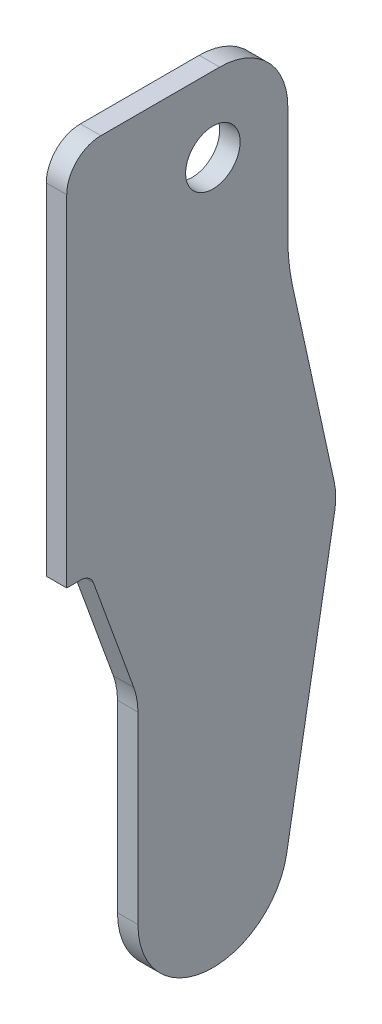
ISO-10303-21;
HEADER;
FILE_DESCRIPTION(('STEP AP214'),'2;1');
FILE_NAME('part.step','',(''),(''),'','','');
FILE_SCHEMA(('AUTOMOTIVE_DESIGN { 1 0 10303 214 1 1 1 1 }'));
ENDSEC;
DATA;
#1=APPLICATION_CONTEXT('core data for automotive mechanical design processes');
#2=APPLICATION_PROTOCOL_DEFINITION('international standard','automotive_design',2000,#1);
#3=PRODUCT_CONTEXT('',#1,'mechanical');
#4=PRODUCT('Part','Part','',(#3));
#5=PRODUCT_RELATED_PRODUCT_CATEGORY('part','',(#4));
#6=PRODUCT_DEFINITION_FORMATION('','',#4);
#7=PRODUCT_DEFINITION_CONTEXT('part definition',#1,'design');
#8=PRODUCT_DEFINITION('design','',#6,#7);
#9=PRODUCT_DEFINITION_SHAPE('','',#8);
#10=(LENGTH_UNIT() NAMED_UNIT(*) SI_UNIT(.MILLI.,.METRE.));
#11=(NAMED_UNIT(*) PLANE_ANGLE_UNIT() SI_UNIT($,.RADIAN.));
#12=(NAMED_UNIT(*) SI_UNIT($,.STERADIAN.) SOLID_ANGLE_UNIT());
#13=UNCERTAINTY_MEASURE_WITH_UNIT(LENGTH_MEASURE(1.E-05),#10,'distance_accuracy_value','');
#14=(GEOMETRIC_REPRESENTATION_CONTEXT(3) GLOBAL_UNCERTAINTY_ASSIGNED_CONTEXT((#13)) GLOBAL_UNIT_ASSIGNED_CONTEXT((#10,
#11,#12)) REPRESENTATION_CONTEXT('',''));
#15=CARTESIAN_POINT('',(0.,0.,0.));
#16=DIRECTION('',(0.,0.,1.));
#17=DIRECTION('',(1.,0.,0.));
#18=AXIS2_PLACEMENT_3D('',#15,#16,#17);
#19=CARTESIAN_POINT('',(17.5,-190.,21.4494897427832));
#20=DIRECTION('',(0.,0.,1.));
#21=DIRECTION('',(1.,0.,0.));
#22=AXIS2_PLACEMENT_3D('',#19,#20,#21);
#23=PLANE('',#22);
#24=DIRECTION('',(0.,1.,0.));
#25=VECTOR('',#24,1.);
#26=CARTESIAN_POINT('',(17.5,-190.,21.4494897427832));
#27=LINE('',#26,#25);
#28=CARTESIAN_POINT('',(17.5,-190.,21.4494897427832));
#29=VERTEX_POINT('',#28);
#30=CARTESIAN_POINT('',(17.5,-140.,21.4494897427832));
#31=VERTEX_POINT('',#30);
#32=EDGE_CURVE('E176',#29,#31,#27,.T.);
#33=ORIENTED_EDGE('',*,*,#32,.T.);
#34=DIRECTION('',(-1.,0.,0.));
#35=VECTOR('',#34,1.);
#36=CARTESIAN_POINT('',(17.5,-140.,21.4494897427832));
#37=LINE('',#36,#35);
#38=CARTESIAN_POINT('',(14.5,-140.,21.4494897427832));
#39=VERTEX_POINT('',#38);
#40=EDGE_CURVE('E245',#31,#39,#37,.T.);
#41=ORIENTED_EDGE('',*,*,#40,.T.);
#42=DIRECTION('',(0.,1.,0.));
#43=VECTOR('',#42,1.);
#44=CARTESIAN_POINT('',(14.5,-190.,21.4494897427832));
#45=LINE('',#44,#43);
#46=CARTESIAN_POINT('',(14.5,-190.,21.4494897427832));
#47=VERTEX_POINT('',#46);
#48=EDGE_CURVE('E213',#47,#39,#45,.T.);
#49=ORIENTED_EDGE('',*,*,#48,.F.);
#50=DIRECTION('',(-1.,0.,0.));
#51=VECTOR('',#50,1.);
#52=CARTESIAN_POINT('',(17.5,-190.,21.4494897427832));
#53=LINE('',#52,#51);
#54=EDGE_CURVE('E243',#29,#47,#53,.T.);
#55=ORIENTED_EDGE('',*,*,#54,.F.);
#56=EDGE_LOOP('',(#33,#41,#49,#55));
#57=FACE_BOUND('',#56,.T.);
#58=ADVANCED_FACE('F39',(#57),#23,.T.);
#59=CARTESIAN_POINT('',(17.5,-190.000000000001,19.40041507642));
#60=DIRECTION('',(0.,-1.,5.28271354274638E-13));
#61=DIRECTION('',(0.,-5.28271354274638E-13,-1.));
#62=AXIS2_PLACEMENT_3D('',#59,#60,#61);
#63=PLANE('',#62);
#64=ORIENTED_EDGE('',*,*,#54,.T.);
#65=DIRECTION('',(0.,5.28271354274638E-13,1.));
#66=VECTOR('',#65,1.);
#67=CARTESIAN_POINT('',(14.5,-190.000000000001,19.40041507642));
#68=LINE('',#67,#66);
#69=CARTESIAN_POINT('',(14.5,-190.000000000002,19.40041507642));
#70=VERTEX_POINT('',#69);
#71=EDGE_CURVE('E180',#70,#47,#68,.T.);
#72=ORIENTED_EDGE('',*,*,#71,.F.);
#73=DIRECTION('',(-1.,0.,0.));
#74=VECTOR('',#73,1.);
#75=CARTESIAN_POINT('',(17.5,-190.000000000002,19.40041507642));
#76=LINE('',#75,#74);
#77=CARTESIAN_POINT('',(17.5,-190.000000000002,19.40041507642));
#78=VERTEX_POINT('',#77);
#79=EDGE_CURVE('E246',#78,#70,#76,.T.);
#80=ORIENTED_EDGE('',*,*,#79,.F.);
#81=DIRECTION('',(0.,5.28271354274638E-13,1.));
#82=VECTOR('',#81,1.);
#83=CARTESIAN_POINT('',(17.5,-190.000000000001,19.40041507642));
#84=LINE('',#83,#82);
#85=EDGE_CURVE('E210',#78,#29,#84,.T.);
#86=ORIENTED_EDGE('',*,*,#85,.T.);
#87=EDGE_LOOP('',(#64,#72,#80,#86));
#88=FACE_BOUND('',#87,.T.);
#89=ADVANCED_FACE('F276',(#88),#63,.T.);
#90=CARTESIAN_POINT('',(17.5,-192.,19.40041507642));
#91=DIRECTION('',(-1.,0.,0.));
#92=DIRECTION('',(0.,0.,1.));
#93=AXIS2_PLACEMENT_3D('',#90,#91,#92);
#94=CYLINDRICAL_SURFACE('',#93,1.99999999999838);
#95=ORIENTED_EDGE('',*,*,#79,.T.);
#96=CARTESIAN_POINT('',(14.5,-192.,19.40041507642));
#97=DIRECTION('',(1.,0.,0.));
#98=DIRECTION('',(0.,0.,1.));
#99=AXIS2_PLACEMENT_3D('',#96,#97,#98);
#100=CIRCLE('',#99,1.99999999999838);
#101=CARTESIAN_POINT('',(14.5,-191.31595971335,17.52102983485));
#102=VERTEX_POINT('',#101);
#103=EDGE_CURVE('E238',#102,#70,#100,.T.);
#104=ORIENTED_EDGE('',*,*,#103,.F.);
#105=DIRECTION('',(-1.,0.,0.));
#106=VECTOR('',#105,1.);
#107=CARTESIAN_POINT('',(17.5,-191.31595971335,17.52102983485));
#108=LINE('',#107,#106);
#109=CARTESIAN_POINT('',(17.5,-191.31595971335,17.52102983485));
#110=VERTEX_POINT('',#109);
#111=EDGE_CURVE('E248',#110,#102,#108,.T.);
#112=ORIENTED_EDGE('',*,*,#111,.F.);
#113=CARTESIAN_POINT('',(17.5,-192.,19.40041507642));
#114=DIRECTION('',(1.,0.,0.));
#115=DIRECTION('',(0.,0.,1.));
#116=AXIS2_PLACEMENT_3D('',#113,#114,#115);
#117=CIRCLE('',#116,1.99999999999838);
#118=EDGE_CURVE('E207',#110,#78,#117,.T.);
#119=ORIENTED_EDGE('',*,*,#118,.T.);
#120=EDGE_LOOP('',(#95,#104,#112,#119));
#121=FACE_BOUND('',#120,.T.);
#122=ADVANCED_FACE('F294',(#121),#94,.F.);
#123=CARTESIAN_POINT('',(17.5,-207.57541031001,11.6030737921409));
#124=DIRECTION('',(0.,-0.342020143325815,0.939692620785855));
#125=DIRECTION('',(0.,-0.939692620785855,-0.342020143325815));
#126=AXIS2_PLACEMENT_3D('',#123,#124,#125);
#127=PLANE('',#126);
#128=ORIENTED_EDGE('',*,*,#111,.T.);
#129=DIRECTION('',(0.,0.939692620785855,0.342020143325814));
#130=VECTOR('',#129,1.);
#131=CARTESIAN_POINT('',(14.5,-207.57541031001,11.6030737921409));
#132=LINE('',#131,#130);
#133=CARTESIAN_POINT('',(14.5,-207.575410310011,11.6030737921414));
#134=VERTEX_POINT('',#133);
#135=EDGE_CURVE('E235',#134,#102,#132,.T.);
#136=ORIENTED_EDGE('',*,*,#135,.F.);
#137=DIRECTION('',(-1.,0.,0.));
#138=VECTOR('',#137,1.);
#139=CARTESIAN_POINT('',(17.5,-207.575410310011,11.6030737921414));
#140=LINE('',#139,#138);
#141=CARTESIAN_POINT('',(17.5,-207.575410310011,11.6030737921414));
#142=VERTEX_POINT('',#141);
#143=EDGE_CURVE('E250',#142,#134,#140,.T.);
#144=ORIENTED_EDGE('',*,*,#143,.F.);
#145=DIRECTION('',(0.,0.939692620785855,0.342020143325814));
#146=VECTOR('',#145,1.);
#147=CARTESIAN_POINT('',(17.5,-207.57541031001,11.6030737921409));
#148=LINE('',#147,#146);
#149=EDGE_CURVE('E204',#142,#110,#148,.T.);
#150=ORIENTED_EDGE('',*,*,#149,.T.);
#151=EDGE_LOOP('',(#128,#136,#144,#150));
#152=FACE_BOUND('',#151,.T.);
#153=ADVANCED_FACE('F329',(#152),#127,.T.);
#154=CARTESIAN_POINT('',(17.5,-210.99561174327,21.));
#155=DIRECTION('',(-1.,0.,0.));
#156=DIRECTION('',(0.,0.,1.));
#157=AXIS2_PLACEMENT_3D('',#154,#155,#156);
#158=CYLINDRICAL_SURFACE('',#157,10.0000000000005);
#159=ORIENTED_EDGE('',*,*,#143,.T.);
#160=CARTESIAN_POINT('',(14.5,-210.99561174327,21.));
#161=DIRECTION('',(1.,0.,0.));
#162=DIRECTION('',(0.,0.,1.));
#163=AXIS2_PLACEMENT_3D('',#160,#161,#162);
#164=CIRCLE('',#163,10.0000000000005);
#165=CARTESIAN_POINT('',(14.5,-210.99561174327,11.));
#166=VERTEX_POINT('',#165);
#167=EDGE_CURVE('E232',#166,#134,#164,.T.);
#168=ORIENTED_EDGE('',*,*,#167,.F.);
#169=DIRECTION('',(-1.,0.,0.));
#170=VECTOR('',#169,1.);
#171=CARTESIAN_POINT('',(17.5,-210.99561174327,11.));
#172=LINE('',#171,#170);
#173=CARTESIAN_POINT('',(17.5,-210.99561174327,11.));
#174=VERTEX_POINT('',#173);
#175=EDGE_CURVE('E252',#174,#166,#172,.T.);
#176=ORIENTED_EDGE('',*,*,#175,.F.);
#177=CARTESIAN_POINT('',(17.5,-210.99561174327,21.));
#178=DIRECTION('',(1.,0.,0.));
#179=DIRECTION('',(0.,0.,1.));
#180=AXIS2_PLACEMENT_3D('',#177,#178,#179);
#181=CIRCLE('',#180,10.0000000000005);
#182=EDGE_CURVE('E201',#174,#142,#181,.T.);
#183=ORIENTED_EDGE('',*,*,#182,.T.);
#184=EDGE_LOOP('',(#159,#168,#176,#183));
#185=FACE_BOUND('',#184,.T.);
#186=ADVANCED_FACE('F325',(#185),#158,.F.);
#187=CARTESIAN_POINT('',(17.5,-238.,10.9999999999979));
#188=DIRECTION('',(0.,0.,1.));
#189=DIRECTION('',(0.,-1.,0.));
#190=AXIS2_PLACEMENT_3D('',#187,#188,#189);
#191=PLANE('',#190);
#192=ORIENTED_EDGE('',*,*,#175,.T.);
#193=DIRECTION('',(0.,1.,0.));
#194=VECTOR('',#193,1.);
#195=CARTESIAN_POINT('',(14.5,-238.,10.9999999999979));
#196=LINE('',#195,#194);
#197=CARTESIAN_POINT('',(14.5,-238.,10.9999999999969));
#198=VERTEX_POINT('',#197);
#199=EDGE_CURVE('E229',#198,#166,#196,.T.);
#200=ORIENTED_EDGE('',*,*,#199,.F.);
#201=DIRECTION('',(-1.,0.,0.));
#202=VECTOR('',#201,1.);
#203=CARTESIAN_POINT('',(17.5,-238.,10.9999999999969));
#204=LINE('',#203,#202);
#205=CARTESIAN_POINT('',(17.5,-238.,10.9999999999969));
#206=VERTEX_POINT('',#205);
#207=EDGE_CURVE('E254',#206,#198,#204,.T.);
#208=ORIENTED_EDGE('',*,*,#207,.F.);
#209=DIRECTION('',(0.,1.,0.));
#210=VECTOR('',#209,1.);
#211=CARTESIAN_POINT('',(17.5,-238.,10.9999999999979));
#212=LINE('',#211,#210);
#213=EDGE_CURVE('E198',#206,#174,#212,.T.);
#214=ORIENTED_EDGE('',*,*,#213,.T.);
#215=EDGE_LOOP('',(#192,#200,#208,#214));
#216=FACE_BOUND('',#215,.T.);
#217=ADVANCED_FACE('F321',(#216),#191,.T.);
#218=CARTESIAN_POINT('',(17.5,-238.,0.));
#219=DIRECTION('',(-1.,0.,0.));
#220=DIRECTION('',(0.,0.,1.));
#221=AXIS2_PLACEMENT_3D('',#218,#219,#220);
#222=CYLINDRICAL_SURFACE('',#221,10.9999999999969);
#223=ORIENTED_EDGE('',*,*,#207,.T.);
#224=CARTESIAN_POINT('',(14.5,-238.,0.));
#225=DIRECTION('',(-1.,0.,0.));
#226=DIRECTION('',(0.,0.,1.));
#227=AXIS2_PLACEMENT_3D('',#224,#225,#226);
#228=CIRCLE('',#227,10.9999999999969);
#229=CARTESIAN_POINT('',(14.5,-239.91012995434,-10.83288528313));
#230=VERTEX_POINT('',#229);
#231=EDGE_CURVE('E226',#230,#198,#228,.T.);
#232=ORIENTED_EDGE('',*,*,#231,.F.);
#233=DIRECTION('',(-1.,0.,0.));
#234=VECTOR('',#233,1.);
#235=CARTESIAN_POINT('',(17.5,-239.91012995434,-10.83288528313));
#236=LINE('',#235,#234);
#237=CARTESIAN_POINT('',(17.5,-239.91012995434,-10.83288528313));
#238=VERTEX_POINT('',#237);
#239=EDGE_CURVE('E256',#238,#230,#236,.T.);
#240=ORIENTED_EDGE('',*,*,#239,.F.);
#241=CARTESIAN_POINT('',(17.5,-238.,0.));
#242=DIRECTION('',(-1.,0.,0.));
#243=DIRECTION('',(0.,0.,1.));
#244=AXIS2_PLACEMENT_3D('',#241,#242,#243);
#245=CIRCLE('',#244,10.9999999999963);
#246=EDGE_CURVE('E196',#238,#206,#245,.T.);
#247=ORIENTED_EDGE('',*,*,#246,.T.);
#248=EDGE_LOOP('',(#223,#232,#240,#247));
#249=FACE_BOUND('',#248,.T.);
#250=ADVANCED_FACE('F317',(#249),#222,.T.);
#251=CARTESIAN_POINT('',(17.5,-199.94512735731,-17.8797935250715));
#252=DIRECTION('',(0.,-0.173648177666962,-0.984807753012202));
#253=DIRECTION('',(0.,0.984807753012202,-0.173648177666962));
#254=AXIS2_PLACEMENT_3D('',#251,#252,#253);
#255=PLANE('',#254);
#256=ORIENTED_EDGE('',*,*,#239,.T.);
#257=DIRECTION('',(0.,-0.984807753012202,0.173648177666962));
#258=VECTOR('',#257,1.);
#259=CARTESIAN_POINT('',(14.5,-199.94512735731,-17.8797935250715));
#260=LINE('',#259,#258);
#261=CARTESIAN_POINT('',(14.5,-199.94512735731,-17.8797935250723));
#262=VERTEX_POINT('',#261);
#263=EDGE_CURVE('E223',#262,#230,#260,.T.);
#264=ORIENTED_EDGE('',*,*,#263,.F.);
#265=DIRECTION('',(-1.,0.,0.));
#266=VECTOR('',#265,1.);
#267=CARTESIAN_POINT('',(17.5,-199.94512735731,-17.8797935250723));
#268=LINE('',#267,#266);
#269=CARTESIAN_POINT('',(17.5,-199.94512735731,-17.8797935250723));
#270=VERTEX_POINT('',#269);
#271=EDGE_CURVE('E258',#270,#262,#268,.T.);
#272=ORIENTED_EDGE('',*,*,#271,.F.);
#273=DIRECTION('',(0.,-0.984807753012202,0.173648177666962));
#274=VECTOR('',#273,1.);
#275=CARTESIAN_POINT('',(17.5,-199.94512735731,-17.8797935250715));
#276=LINE('',#275,#274);
#277=EDGE_CURVE('E193',#270,#238,#276,.T.);
#278=ORIENTED_EDGE('',*,*,#277,.T.);
#279=EDGE_LOOP('',(#256,#264,#272,#278));
#280=FACE_BOUND('',#279,.T.);
#281=ADVANCED_FACE('F313',(#280),#255,.T.);
#282=CARTESIAN_POINT('',(17.5,-198.20864558064,-8.031715994952));
#283=DIRECTION('',(-1.,0.,0.));
#284=DIRECTION('',(0.,0.,1.));
#285=AXIS2_PLACEMENT_3D('',#282,#283,#284);
#286=CYLINDRICAL_SURFACE('',#285,9.99999999999843);
#287=ORIENTED_EDGE('',*,*,#271,.T.);
#288=CARTESIAN_POINT('',(14.5,-198.20864558064,-8.031715994952));
#289=DIRECTION('',(-1.,0.,0.));
#290=DIRECTION('',(0.,0.,1.));
#291=AXIS2_PLACEMENT_3D('',#288,#289,#290);
#292=CIRCLE('',#291,9.99999999999843);
#293=CARTESIAN_POINT('',(14.5,-196.07054058552,-17.80046755438));
#294=VERTEX_POINT('',#293);
#295=EDGE_CURVE('E220',#294,#262,#292,.T.);
#296=ORIENTED_EDGE('',*,*,#295,.F.);
#297=DIRECTION('',(-1.,0.,0.));
#298=VECTOR('',#297,1.);
#299=CARTESIAN_POINT('',(17.5,-196.07054058552,-17.80046755438));
#300=LINE('',#299,#298);
#301=CARTESIAN_POINT('',(17.5,-196.07054058552,-17.80046755438));
#302=VERTEX_POINT('',#301);
#303=EDGE_CURVE('E260',#302,#294,#300,.T.);
#304=ORIENTED_EDGE('',*,*,#303,.F.);
#305=CARTESIAN_POINT('',(17.5,-198.20864558064,-8.031715994952));
#306=DIRECTION('',(-1.,0.,0.));
#307=DIRECTION('',(0.,0.,1.));
#308=AXIS2_PLACEMENT_3D('',#305,#306,#307);
#309=CIRCLE('',#308,9.99999999999843);
#310=EDGE_CURVE('E190',#302,#270,#309,.T.);
#311=ORIENTED_EDGE('',*,*,#310,.T.);
#312=EDGE_LOOP('',(#287,#296,#304,#311));
#313=FACE_BOUND('',#312,.T.);
#314=ADVANCED_FACE('F309',(#313),#286,.T.);
#315=CARTESIAN_POINT('',(17.5,-168.16964120508,-11.6937453217096));
#316=DIRECTION('',(0.,0.213810499511105,-0.976875155943077));
#317=DIRECTION('',(0.,0.976875155943077,0.213810499511105));
#318=AXIS2_PLACEMENT_3D('',#315,#316,#317);
#319=PLANE('',#318);
#320=ORIENTED_EDGE('',*,*,#303,.T.);
#321=DIRECTION('',(0.,-0.976875155943077,-0.213810499511105));
#322=VECTOR('',#321,1.);
#323=CARTESIAN_POINT('',(14.5,-168.16964120508,-11.6937453217096));
#324=LINE('',#323,#322);
#325=CARTESIAN_POINT('',(14.5,-168.16964120508,-11.6937453217094));
#326=VERTEX_POINT('',#325);
#327=EDGE_CURVE('E217',#326,#294,#324,.T.);
#328=ORIENTED_EDGE('',*,*,#327,.F.);
#329=DIRECTION('',(-1.,0.,0.));
#330=VECTOR('',#329,1.);
#331=CARTESIAN_POINT('',(17.5,-168.16964120508,-11.6937453217094));
#332=LINE('',#331,#330);
#333=CARTESIAN_POINT('',(17.5,-168.16964120508,-11.6937453217094));
#334=VERTEX_POINT('',#333);
#335=EDGE_CURVE('E262',#334,#326,#332,.T.);
#336=ORIENTED_EDGE('',*,*,#335,.F.);
#337=DIRECTION('',(0.,-0.976875155943077,-0.213810499511105));
#338=VECTOR('',#337,1.);
#339=CARTESIAN_POINT('',(17.5,-168.16964120508,-11.6937453217096));
#340=LINE('',#339,#338);
#341=EDGE_CURVE('E187',#334,#302,#340,.T.);
#342=ORIENTED_EDGE('',*,*,#341,.T.);
#343=EDGE_LOOP('',(#320,#328,#336,#342));
#344=FACE_BOUND('',#343,.T.);
#345=ADVANCED_FACE('F305',(#344),#319,.T.);
#346=CARTESIAN_POINT('',(17.5,-161.75532621974,-41.));
#347=DIRECTION('',(-1.,0.,0.));
#348=DIRECTION('',(0.,0.,1.));
#349=AXIS2_PLACEMENT_3D('',#346,#347,#348);
#350=CYLINDRICAL_SURFACE('',#349,29.9999999999998);
#351=ORIENTED_EDGE('',*,*,#335,.T.);
#352=CARTESIAN_POINT('',(14.5,-161.75532621974,-41.));
#353=DIRECTION('',(1.,0.,0.));
#354=DIRECTION('',(0.,0.,1.));
#355=AXIS2_PLACEMENT_3D('',#352,#353,#354);
#356=CIRCLE('',#355,29.9999999999998);
#357=CARTESIAN_POINT('',(14.5,-161.75532621974,-11.));
#358=VERTEX_POINT('',#357);
#359=EDGE_CURVE('E153',#358,#326,#356,.T.);
#360=ORIENTED_EDGE('',*,*,#359,.F.);
#361=DIRECTION('',(-1.,0.,0.));
#362=VECTOR('',#361,1.);
#363=CARTESIAN_POINT('',(17.5,-161.75532621974,-11.));
#364=LINE('',#363,#362);
#365=CARTESIAN_POINT('',(17.5,-161.75532621974,-11.));
#366=VERTEX_POINT('',#365);
#367=EDGE_CURVE('E149',#366,#358,#364,.T.);
#368=ORIENTED_EDGE('',*,*,#367,.F.);
#369=CARTESIAN_POINT('',(17.5,-161.75532621974,-41.));
#370=DIRECTION('',(1.,0.,0.));
#371=DIRECTION('',(0.,0.,1.));
#372=AXIS2_PLACEMENT_3D('',#369,#370,#371);
#373=CIRCLE('',#372,29.9999999999998);
#374=EDGE_CURVE('E184',#366,#334,#373,.T.);
#375=ORIENTED_EDGE('',*,*,#374,.T.);
#376=EDGE_LOOP('',(#351,#360,#368,#375));
#377=FACE_BOUND('',#376,.T.);
#378=ADVANCED_FACE('F302',(#377),#350,.F.);
#379=CARTESIAN_POINT('',(17.5,-153.292893218813,-10.9999999999989));
#380=DIRECTION('',(0.,1.32834234824646E-13,-1.));
#381=DIRECTION('',(0.,1.,1.32834234824646E-13));
#382=AXIS2_PLACEMENT_3D('',#379,#380,#381);
#383=PLANE('',#382);
#384=ORIENTED_EDGE('',*,*,#367,.T.);
#385=DIRECTION('',(0.,-1.,-1.32834234824646E-13));
#386=VECTOR('',#385,1.);
#387=CARTESIAN_POINT('',(14.5,-153.292893218813,-10.9999999999989));
#388=LINE('',#387,#386);
#389=CARTESIAN_POINT('',(14.5,-145.,-10.9999999999983));
#390=VERTEX_POINT('',#389);
#391=EDGE_CURVE('E144',#390,#358,#388,.T.);
#392=ORIENTED_EDGE('',*,*,#391,.F.);
#393=DIRECTION('',(-1.,0.,0.));
#394=VECTOR('',#393,1.);
#395=CARTESIAN_POINT('',(43.370057685087,-145.,-10.9999999999983));
#396=LINE('',#395,#394);
#397=CARTESIAN_POINT('',(17.5,-145.,-10.9999999999983));
#398=VERTEX_POINT('',#397);
#399=EDGE_CURVE('E148',#398,#390,#396,.T.);
#400=ORIENTED_EDGE('',*,*,#399,.F.);
#401=DIRECTION('',(0.,-1.,-1.32834234824646E-13));
#402=VECTOR('',#401,1.);
#403=CARTESIAN_POINT('',(17.5,-153.292893218813,-10.9999999999989));
#404=LINE('',#403,#402);
#405=EDGE_CURVE('E182',#398,#366,#404,.T.);
#406=ORIENTED_EDGE('',*,*,#405,.T.);
#407=EDGE_LOOP('',(#384,#392,#400,#406));
#408=FACE_BOUND('',#407,.T.);
#409=ADVANCED_FACE('F146',(#408),#383,.T.);
#410=CARTESIAN_POINT('',(17.5,-135.,21.4494897427832));
#411=DIRECTION('',(0.,1.,0.));
#412=DIRECTION('',(0.,0.,1.));
#413=AXIS2_PLACEMENT_3D('',#410,#411,#412);
#414=PLANE('',#413);
#415=DIRECTION('',(0.,0.,-1.));
#416=VECTOR('',#415,1.);
#417=CARTESIAN_POINT('',(14.5,-135.,21.4494897427832));
#418=LINE('',#417,#416);
#419=CARTESIAN_POINT('',(14.5,-135.,16.4494897427832));
#420=VERTEX_POINT('',#419);
#421=CARTESIAN_POINT('',(14.5,-135.,-0.999999999998242));
#422=VERTEX_POINT('',#421);
#423=EDGE_CURVE('E154',#420,#422,#418,.T.);
#424=ORIENTED_EDGE('',*,*,#423,.F.);
#425=DIRECTION('',(-1.,0.,0.));
#426=VECTOR('',#425,1.);
#427=CARTESIAN_POINT('',(17.5,-135.,16.4494897427832));
#428=LINE('',#427,#426);
#429=CARTESIAN_POINT('',(17.5,-135.,16.4494897427832));
#430=VERTEX_POINT('',#429);
#431=EDGE_CURVE('E47',#420,#430,#428,.F.);
#432=ORIENTED_EDGE('',*,*,#431,.T.);
#433=DIRECTION('',(0.,0.,-1.));
#434=VECTOR('',#433,1.);
#435=CARTESIAN_POINT('',(17.5,-135.,21.4494897427832));
#436=LINE('',#435,#434);
#437=CARTESIAN_POINT('',(17.5,-135.,-0.999999999998242));
#438=VERTEX_POINT('',#437);
#439=EDGE_CURVE('E179',#430,#438,#436,.T.);
#440=ORIENTED_EDGE('',*,*,#439,.T.);
#441=DIRECTION('',(-1.,0.,0.));
#442=VECTOR('',#441,1.);
#443=CARTESIAN_POINT('',(43.370057685087,-135.,-0.999999999998242));
#444=LINE('',#443,#442);
#445=EDGE_CURVE('E164',#438,#422,#444,.T.);
#446=ORIENTED_EDGE('',*,*,#445,.T.);
#447=EDGE_LOOP('',(#424,#432,#440,#446));
#448=FACE_BOUND('',#447,.T.);
#449=ADVANCED_FACE('F297',(#448),#414,.T.);
#450=CARTESIAN_POINT('',(17.5,-137.,7.292893218813));
#451=DIRECTION('',(-1.,0.,0.));
#452=DIRECTION('',(0.,0.,1.));
#453=AXIS2_PLACEMENT_3D('',#450,#451,#452);
#454=PLANE('',#453);
#455=CARTESIAN_POINT('',(17.5,-146.,1.54459778300975E-11));
#456=DIRECTION('',(-1.,0.,0.));
#457=DIRECTION('',(0.,0.,1.));
#458=AXIS2_PLACEMENT_3D('',#455,#456,#457);
#459=CIRCLE('',#458,3.99999999998523);
#460=CARTESIAN_POINT('',(17.5,-146.,4.00000000000068));
#461=VERTEX_POINT('',#460);
#462=EDGE_CURVE('E168',#461,#461,#459,.T.);
#463=ORIENTED_EDGE('',*,*,#462,.T.);
#464=EDGE_LOOP('',(#463));
#465=FACE_BOUND('',#464,.T.);
#466=ORIENTED_EDGE('',*,*,#439,.F.);
#467=CARTESIAN_POINT('',(17.5,-140.,16.4494897427832));
#468=DIRECTION('',(-1.,0.,0.));
#469=DIRECTION('',(0.,0.,1.));
#470=AXIS2_PLACEMENT_3D('',#467,#468,#469);
#471=CIRCLE('',#470,5.);
#472=EDGE_CURVE('E11',#430,#31,#471,.F.);
#473=ORIENTED_EDGE('',*,*,#472,.T.);
#474=ORIENTED_EDGE('',*,*,#32,.F.);
#475=ORIENTED_EDGE('',*,*,#85,.F.);
#476=ORIENTED_EDGE('',*,*,#118,.F.);
#477=ORIENTED_EDGE('',*,*,#149,.F.);
#478=ORIENTED_EDGE('',*,*,#182,.F.);
#479=ORIENTED_EDGE('',*,*,#213,.F.);
#480=ORIENTED_EDGE('',*,*,#246,.F.);
#481=ORIENTED_EDGE('',*,*,#277,.F.);
#482=ORIENTED_EDGE('',*,*,#310,.F.);
#483=ORIENTED_EDGE('',*,*,#341,.F.);
#484=ORIENTED_EDGE('',*,*,#374,.F.);
#485=ORIENTED_EDGE('',*,*,#405,.F.);
#486=CARTESIAN_POINT('',(17.5,-145.,-0.999999999998313));
#487=DIRECTION('',(-1.,0.,0.));
#488=DIRECTION('',(0.,0.,1.));
#489=AXIS2_PLACEMENT_3D('',#486,#487,#488);
#490=CIRCLE('',#489,10.);
#491=EDGE_CURVE('E163',#438,#398,#490,.T.);
#492=ORIENTED_EDGE('',*,*,#491,.F.);
#493=EDGE_LOOP('',(#466,#473,#474,#475,#476,#477,#478,#479,#480,#481,#482,#483,#484,#485,#492));
#494=FACE_BOUND('',#493,.T.);
#495=ADVANCED_FACE('F279',(#465,#494),#454,.F.);
#496=CARTESIAN_POINT('',(14.5,-137.,7.292893218813));
#497=DIRECTION('',(-1.,0.,0.));
#498=DIRECTION('',(0.,0.,1.));
#499=AXIS2_PLACEMENT_3D('',#496,#497,#498);
#500=PLANE('',#499);
#501=CARTESIAN_POINT('',(14.5,-146.,1.54459778300975E-11));
#502=DIRECTION('',(-1.,0.,0.));
#503=DIRECTION('',(0.,0.,1.));
#504=AXIS2_PLACEMENT_3D('',#501,#502,#503);
#505=CIRCLE('',#504,3.99999999998523);
#506=CARTESIAN_POINT('',(14.5,-146.,4.00000000000068));
#507=VERTEX_POINT('',#506);
#508=EDGE_CURVE('E171',#507,#507,#505,.T.);
#509=ORIENTED_EDGE('',*,*,#508,.F.);
#510=EDGE_LOOP('',(#509));
#511=FACE_BOUND('',#510,.T.);
#512=ORIENTED_EDGE('',*,*,#48,.T.);
#513=CARTESIAN_POINT('',(14.5,-140.,16.4494897427832));
#514=DIRECTION('',(-1.,0.,0.));
#515=DIRECTION('',(0.,0.,1.));
#516=AXIS2_PLACEMENT_3D('',#513,#514,#515);
#517=CIRCLE('',#516,5.);
#518=EDGE_CURVE('E61',#39,#420,#517,.T.);
#519=ORIENTED_EDGE('',*,*,#518,.T.);
#520=ORIENTED_EDGE('',*,*,#423,.T.);
#521=CARTESIAN_POINT('',(14.5,-145.,-0.999999999998313));
#522=DIRECTION('',(-1.,0.,0.));
#523=DIRECTION('',(0.,0.,1.));
#524=AXIS2_PLACEMENT_3D('',#521,#522,#523);
#525=CIRCLE('',#524,10.);
#526=EDGE_CURVE('E161',#390,#422,#525,.F.);
#527=ORIENTED_EDGE('',*,*,#526,.F.);
#528=ORIENTED_EDGE('',*,*,#391,.T.);
#529=ORIENTED_EDGE('',*,*,#359,.T.);
#530=ORIENTED_EDGE('',*,*,#327,.T.);
#531=ORIENTED_EDGE('',*,*,#295,.T.);
#532=ORIENTED_EDGE('',*,*,#263,.T.);
#533=ORIENTED_EDGE('',*,*,#231,.T.);
#534=ORIENTED_EDGE('',*,*,#199,.T.);
#535=ORIENTED_EDGE('',*,*,#167,.T.);
#536=ORIENTED_EDGE('',*,*,#135,.T.);
#537=ORIENTED_EDGE('',*,*,#103,.T.);
#538=ORIENTED_EDGE('',*,*,#71,.T.);
#539=EDGE_LOOP('',(#512,#519,#520,#527,#528,#529,#530,#531,#532,#533,#534,#535,#536,#537,#538));
#540=FACE_BOUND('',#539,.T.);
#541=ADVANCED_FACE('F166',(#511,#540),#500,.T.);
#542=CARTESIAN_POINT('',(43.370057685087,-145.,-0.999999999998313));
#543=DIRECTION('',(-1.,0.,0.));
#544=DIRECTION('',(0.,0.,1.));
#545=AXIS2_PLACEMENT_3D('',#542,#543,#544);
#546=CYLINDRICAL_SURFACE('',#545,10.);
#547=ORIENTED_EDGE('',*,*,#445,.F.);
#548=ORIENTED_EDGE('',*,*,#491,.T.);
#549=ORIENTED_EDGE('',*,*,#399,.T.);
#550=ORIENTED_EDGE('',*,*,#526,.T.);
#551=EDGE_LOOP('',(#547,#548,#549,#550));
#552=FACE_BOUND('',#551,.T.);
#553=ADVANCED_FACE('F160',(#552),#546,.T.);
#554=CARTESIAN_POINT('',(17.5,-140.,16.4494897427832));
#555=DIRECTION('',(-1.,0.,0.));
#556=DIRECTION('',(0.,0.,1.));
#557=AXIS2_PLACEMENT_3D('',#554,#555,#556);
#558=CYLINDRICAL_SURFACE('',#557,5.);
#559=ORIENTED_EDGE('',*,*,#472,.F.);
#560=ORIENTED_EDGE('',*,*,#431,.F.);
#561=ORIENTED_EDGE('',*,*,#518,.F.);
#562=ORIENTED_EDGE('',*,*,#40,.F.);
#563=EDGE_LOOP('',(#559,#560,#561,#562));
#564=FACE_BOUND('',#563,.T.);
#565=ADVANCED_FACE('F41',(#564),#558,.T.);
#566=CARTESIAN_POINT('',(24.5,-146.,1.54459778300975E-11));
#567=DIRECTION('',(-1.,0.,0.));
#568=DIRECTION('',(0.,0.,1.));
#569=AXIS2_PLACEMENT_3D('',#566,#567,#568);
#570=CYLINDRICAL_SURFACE('',#569,3.99999999998523);
#571=ORIENTED_EDGE('',*,*,#508,.T.);
#572=EDGE_LOOP('',(#571));
#573=FACE_BOUND('',#572,.T.);
#574=ORIENTED_EDGE('',*,*,#462,.F.);
#575=EDGE_LOOP('',(#574));
#576=FACE_BOUND('',#575,.T.);
#577=ADVANCED_FACE('F282',(#573,#576),#570,.F.);
#578=CLOSED_SHELL('',(#58,#89,#122,#153,#186,#217,#250,#281,#314,#345,#378,#409,#449,#495,#541,
#553,#565,#577));
#579=MANIFOLD_SOLID_BREP('B2',#578);
#580=ADVANCED_BREP_SHAPE_REPRESENTATION('',(#18,#579),#14);
#581=SHAPE_DEFINITION_REPRESENTATION(#9,#580);
ENDSEC;
END-ISO-10303-21;
